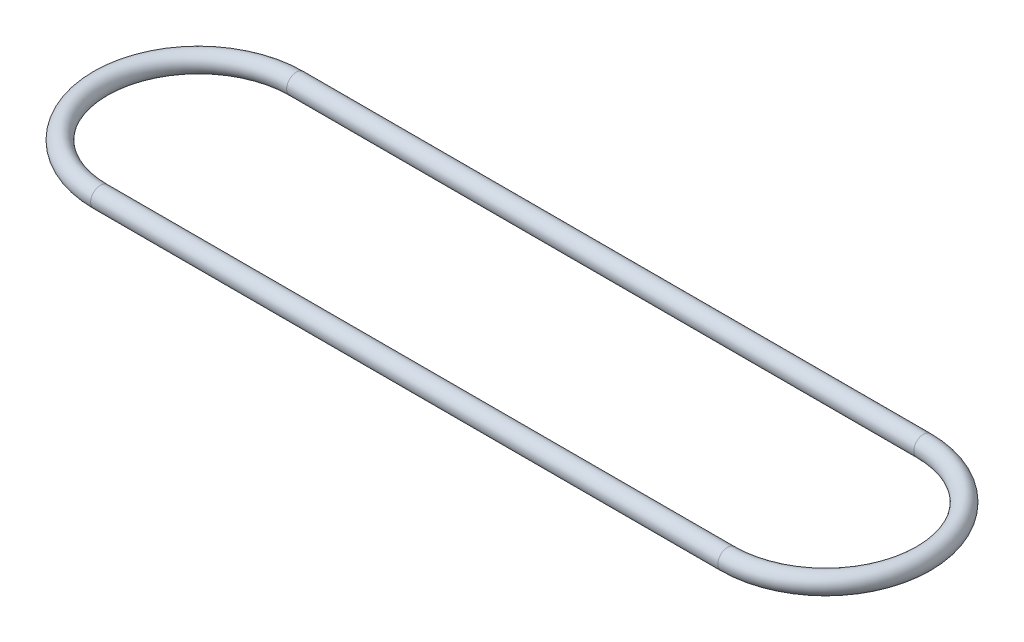
ISO-10303-21;
HEADER;
FILE_DESCRIPTION(('STEP AP214'),'2;1');
FILE_NAME('part.step','',(''),(''),'','','');
FILE_SCHEMA(('AUTOMOTIVE_DESIGN { 1 0 10303 214 1 1 1 1 }'));
ENDSEC;
DATA;
#1=APPLICATION_CONTEXT('core data for automotive mechanical design processes');
#2=APPLICATION_PROTOCOL_DEFINITION('international standard','automotive_design',2000,#1);
#3=PRODUCT_CONTEXT('',#1,'mechanical');
#4=PRODUCT('Part','Part','',(#3));
#5=PRODUCT_RELATED_PRODUCT_CATEGORY('part','',(#4));
#6=PRODUCT_DEFINITION_FORMATION('','',#4);
#7=PRODUCT_DEFINITION_CONTEXT('part definition',#1,'design');
#8=PRODUCT_DEFINITION('design','',#6,#7);
#9=PRODUCT_DEFINITION_SHAPE('','',#8);
#10=(LENGTH_UNIT() NAMED_UNIT(*) SI_UNIT(.MILLI.,.METRE.));
#11=(NAMED_UNIT(*) PLANE_ANGLE_UNIT() SI_UNIT($,.RADIAN.));
#12=(NAMED_UNIT(*) SI_UNIT($,.STERADIAN.) SOLID_ANGLE_UNIT());
#13=UNCERTAINTY_MEASURE_WITH_UNIT(LENGTH_MEASURE(1.E-05),#10,'distance_accuracy_value','');
#14=(GEOMETRIC_REPRESENTATION_CONTEXT(3) GLOBAL_UNCERTAINTY_ASSIGNED_CONTEXT((#13)) GLOBAL_UNIT_ASSIGNED_CONTEXT((#10,
#11,#12)) REPRESENTATION_CONTEXT('',''));
#15=CARTESIAN_POINT('',(0.,0.,0.));
#16=DIRECTION('',(0.,0.,1.));
#17=DIRECTION('',(1.,0.,0.));
#18=AXIS2_PLACEMENT_3D('',#15,#16,#17);
#19=CARTESIAN_POINT('',(0.,0.,0.));
#20=DIRECTION('',(0.,-1.,0.));
#21=DIRECTION('',(0.,0.,-1.));
#22=AXIS2_PLACEMENT_3D('',#19,#20,#21);
#23=TOROIDAL_SURFACE('',#22,31.75,3.175);
#24=CARTESIAN_POINT('',(0.,0.,31.75));
#25=DIRECTION('',(1.,0.,0.));
#26=DIRECTION('',(0.,0.,-1.));
#27=AXIS2_PLACEMENT_3D('',#24,#25,#26);
#28=CIRCLE('',#27,3.175);
#29=CARTESIAN_POINT('',(0.,0.,34.925));
#30=VERTEX_POINT('',#29);
#31=EDGE_CURVE('E45',#30,#30,#28,.T.);
#32=CARTESIAN_POINT('',(0.,0.,-31.75));
#33=DIRECTION('',(-1.,0.,0.));
#34=DIRECTION('',(0.,0.,1.));
#35=AXIS2_PLACEMENT_3D('',#32,#33,#34);
#36=CIRCLE('',#35,3.175);
#37=CARTESIAN_POINT('',(0.,0.,-34.925));
#38=VERTEX_POINT('',#37);
#39=EDGE_CURVE('E41',#38,#38,#36,.T.);
#40=CARTESIAN_POINT('',(0.,0.,0.));
#41=DIRECTION('',(0.,-1.,0.));
#42=DIRECTION('',(0.,0.,-1.));
#43=AXIS2_PLACEMENT_3D('',#40,#41,#42);
#44=CIRCLE('',#43,34.925);
#45=EDGE_CURVE('',#30,#38,#44,.T.);
#46=ORIENTED_EDGE('',*,*,#31,.F.);
#47=ORIENTED_EDGE('',*,*,#39,.T.);
#48=ORIENTED_EDGE('',*,*,#45,.T.);
#49=ORIENTED_EDGE('',*,*,#45,.F.);
#50=EDGE_LOOP('',(#46,#48,#47,#49));
#51=FACE_BOUND('',#50,.T.);
#52=ADVANCED_FACE('F30',(#51),#23,.T.);
#53=CARTESIAN_POINT('',(0.,0.,-31.75));
#54=DIRECTION('',(1.,0.,0.));
#55=DIRECTION('',(0.,0.,-1.));
#56=AXIS2_PLACEMENT_3D('',#53,#54,#55);
#57=CYLINDRICAL_SURFACE('',#56,3.175);
#58=CARTESIAN_POINT('',(203.2,0.,-31.75));
#59=DIRECTION('',(-1.,0.,0.));
#60=DIRECTION('',(0.,0.,1.));
#61=AXIS2_PLACEMENT_3D('',#58,#59,#60);
#62=CIRCLE('',#61,3.175);
#63=CARTESIAN_POINT('',(203.2,0.,-34.925));
#64=VERTEX_POINT('',#63);
#65=EDGE_CURVE('E37',#64,#64,#62,.T.);
#66=ORIENTED_EDGE('',*,*,#65,.T.);
#67=EDGE_LOOP('',(#66));
#68=FACE_BOUND('',#67,.T.);
#69=ORIENTED_EDGE('',*,*,#39,.F.);
#70=EDGE_LOOP('',(#69));
#71=FACE_BOUND('',#70,.T.);
#72=ADVANCED_FACE('F54',(#68,#71),#57,.T.);
#73=CARTESIAN_POINT('',(203.2,0.,0.));
#74=DIRECTION('',(0.,-1.,0.));
#75=DIRECTION('',(0.,0.,-1.));
#76=AXIS2_PLACEMENT_3D('',#73,#74,#75);
#77=TOROIDAL_SURFACE('',#76,31.75,3.175);
#78=CARTESIAN_POINT('',(203.2,0.,31.75));
#79=DIRECTION('',(1.,0.,0.));
#80=DIRECTION('',(0.,0.,-1.));
#81=AXIS2_PLACEMENT_3D('',#78,#79,#80);
#82=CIRCLE('',#81,3.175);
#83=CARTESIAN_POINT('',(203.2,0.,34.925));
#84=VERTEX_POINT('',#83);
#85=EDGE_CURVE('E10',#84,#84,#82,.T.);
#86=CARTESIAN_POINT('',(203.2,0.,0.));
#87=DIRECTION('',(0.,-1.,0.));
#88=DIRECTION('',(0.,0.,-1.));
#89=AXIS2_PLACEMENT_3D('',#86,#87,#88);
#90=CIRCLE('',#89,34.925);
#91=EDGE_CURVE('',#64,#84,#90,.T.);
#92=ORIENTED_EDGE('',*,*,#65,.F.);
#93=ORIENTED_EDGE('',*,*,#85,.T.);
#94=ORIENTED_EDGE('',*,*,#91,.T.);
#95=ORIENTED_EDGE('',*,*,#91,.F.);
#96=EDGE_LOOP('',(#92,#94,#93,#95));
#97=FACE_BOUND('',#96,.T.);
#98=ADVANCED_FACE('F60',(#97),#77,.T.);
#99=CARTESIAN_POINT('',(203.2,0.,31.75));
#100=DIRECTION('',(-1.,0.,0.));
#101=DIRECTION('',(0.,0.,1.));
#102=AXIS2_PLACEMENT_3D('',#99,#100,#101);
#103=CYLINDRICAL_SURFACE('',#102,3.175);
#104=ORIENTED_EDGE('',*,*,#31,.T.);
#105=EDGE_LOOP('',(#104));
#106=FACE_BOUND('',#105,.T.);
#107=ORIENTED_EDGE('',*,*,#85,.F.);
#108=EDGE_LOOP('',(#107));
#109=FACE_BOUND('',#108,.T.);
#110=ADVANCED_FACE('F32',(#106,#109),#103,.T.);
#111=CLOSED_SHELL('',(#52,#72,#98,#110));
#112=MANIFOLD_SOLID_BREP('B2',#111);
#113=ADVANCED_BREP_SHAPE_REPRESENTATION('',(#18,#112),#14);
#114=SHAPE_DEFINITION_REPRESENTATION(#9,#113);
ENDSEC;
END-ISO-10303-21;
